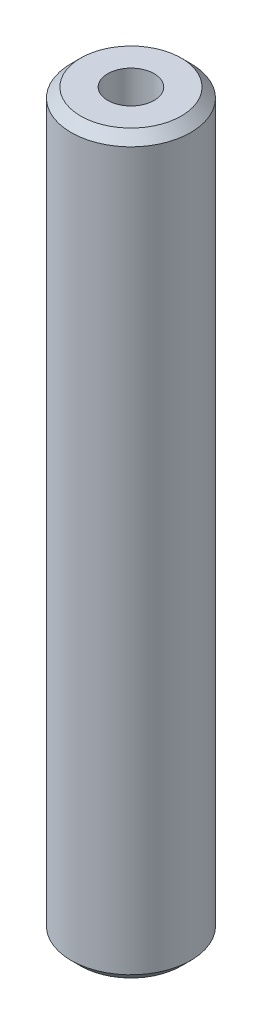
ISO-10303-21;
HEADER;
FILE_DESCRIPTION(('STEP AP214'),'2;1');
FILE_NAME('part.step','',(''),(''),'','','');
FILE_SCHEMA(('AUTOMOTIVE_DESIGN { 1 0 10303 214 1 1 1 1 }'));
ENDSEC;
DATA;
#1=APPLICATION_CONTEXT('core data for automotive mechanical design processes');
#2=APPLICATION_PROTOCOL_DEFINITION('international standard','automotive_design',2000,#1);
#3=PRODUCT_CONTEXT('',#1,'mechanical');
#4=PRODUCT('Part','Part','',(#3));
#5=PRODUCT_RELATED_PRODUCT_CATEGORY('part','',(#4));
#6=PRODUCT_DEFINITION_FORMATION('','',#4);
#7=PRODUCT_DEFINITION_CONTEXT('part definition',#1,'design');
#8=PRODUCT_DEFINITION('design','',#6,#7);
#9=PRODUCT_DEFINITION_SHAPE('','',#8);
#10=(LENGTH_UNIT() NAMED_UNIT(*) SI_UNIT(.MILLI.,.METRE.));
#11=(NAMED_UNIT(*) PLANE_ANGLE_UNIT() SI_UNIT($,.RADIAN.));
#12=(NAMED_UNIT(*) SI_UNIT($,.STERADIAN.) SOLID_ANGLE_UNIT());
#13=UNCERTAINTY_MEASURE_WITH_UNIT(LENGTH_MEASURE(1.E-05),#10,'distance_accuracy_value','');
#14=(GEOMETRIC_REPRESENTATION_CONTEXT(3) GLOBAL_UNCERTAINTY_ASSIGNED_CONTEXT((#13)) GLOBAL_UNIT_ASSIGNED_CONTEXT((#10,
#11,#12)) REPRESENTATION_CONTEXT('',''));
#15=CARTESIAN_POINT('',(0.,0.,0.));
#16=DIRECTION('',(0.,0.,1.));
#17=DIRECTION('',(1.,0.,0.));
#18=AXIS2_PLACEMENT_3D('',#15,#16,#17);
#19=CARTESIAN_POINT('',(0.,153.861780059659,0.));
#20=DIRECTION('',(0.,-1.,0.));
#21=DIRECTION('',(0.,0.,-1.));
#22=AXIS2_PLACEMENT_3D('',#19,#20,#21);
#23=CYLINDRICAL_SURFACE('',#22,12.5);
#24=CARTESIAN_POINT('',(0.,151.870339190849,0.));
#25=DIRECTION('',(0.,1.,0.));
#26=DIRECTION('',(0.,0.,1.));
#27=AXIS2_PLACEMENT_3D('',#24,#25,#26);
#28=CIRCLE('',#27,12.5);
#29=CARTESIAN_POINT('',(0.,151.870339190849,12.5));
#30=VERTEX_POINT('',#29);
#31=EDGE_CURVE('E50',#30,#30,#28,.F.);
#32=ORIENTED_EDGE('',*,*,#31,.T.);
#33=EDGE_LOOP('',(#32));
#34=FACE_BOUND('',#33,.T.);
#35=CARTESIAN_POINT('',(0.,1.99144086881009,0.));
#36=DIRECTION('',(0.,1.,0.));
#37=DIRECTION('',(0.,0.,1.));
#38=AXIS2_PLACEMENT_3D('',#35,#36,#37);
#39=CIRCLE('',#38,12.5);
#40=CARTESIAN_POINT('',(0.,1.99144086881009,12.5));
#41=VERTEX_POINT('',#40);
#42=EDGE_CURVE('E51',#41,#41,#39,.T.);
#43=ORIENTED_EDGE('',*,*,#42,.T.);
#44=EDGE_LOOP('',(#43));
#45=FACE_BOUND('',#44,.T.);
#46=ADVANCED_FACE('F39',(#34,#45),#23,.T.);
#47=CARTESIAN_POINT('',(0.,153.861780059659,0.));
#48=DIRECTION('',(0.,1.,0.));
#49=DIRECTION('',(0.,0.,1.));
#50=AXIS2_PLACEMENT_3D('',#47,#48,#49);
#51=PLANE('',#50);
#52=CARTESIAN_POINT('',(0.,153.861780059659,0.));
#53=DIRECTION('',(0.,1.,0.));
#54=DIRECTION('',(0.,0.,1.));
#55=AXIS2_PLACEMENT_3D('',#52,#53,#54);
#56=CIRCLE('',#55,10.5085591311899);
#57=CARTESIAN_POINT('',(0.,153.861780059659,10.5085591311899));
#58=VERTEX_POINT('',#57);
#59=EDGE_CURVE('E54',#58,#58,#56,.T.);
#60=ORIENTED_EDGE('',*,*,#59,.T.);
#61=EDGE_LOOP('',(#60));
#62=FACE_BOUND('',#61,.T.);
#63=CARTESIAN_POINT('',(0.,153.861780059659,0.));
#64=DIRECTION('',(0.,1.,0.));
#65=DIRECTION('',(0.,0.,1.));
#66=AXIS2_PLACEMENT_3D('',#63,#64,#65);
#67=CIRCLE('',#66,4.85060590893358);
#68=CARTESIAN_POINT('',(0.,153.861780059659,4.85060590893358));
#69=VERTEX_POINT('',#68);
#70=EDGE_CURVE('E58',#69,#69,#67,.T.);
#71=ORIENTED_EDGE('',*,*,#70,.F.);
#72=EDGE_LOOP('',(#71));
#73=FACE_BOUND('',#72,.T.);
#74=ADVANCED_FACE('F69',(#62,#73),#51,.T.);
#75=CARTESIAN_POINT('',(0.,0.,0.));
#76=DIRECTION('',(0.,1.,0.));
#77=DIRECTION('',(0.,0.,1.));
#78=AXIS2_PLACEMENT_3D('',#75,#76,#77);
#79=PLANE('',#78);
#80=CARTESIAN_POINT('',(0.,0.,0.));
#81=DIRECTION('',(0.,1.,0.));
#82=DIRECTION('',(0.,0.,1.));
#83=AXIS2_PLACEMENT_3D('',#80,#81,#82);
#84=CIRCLE('',#83,10.5085591311899);
#85=CARTESIAN_POINT('',(0.,0.,10.5085591311899));
#86=VERTEX_POINT('',#85);
#87=EDGE_CURVE('E10',#86,#86,#84,.F.);
#88=ORIENTED_EDGE('',*,*,#87,.T.);
#89=EDGE_LOOP('',(#88));
#90=FACE_BOUND('',#89,.T.);
#91=CARTESIAN_POINT('',(0.,0.,0.));
#92=DIRECTION('',(0.,1.,0.));
#93=DIRECTION('',(0.,0.,1.));
#94=AXIS2_PLACEMENT_3D('',#91,#92,#93);
#95=CIRCLE('',#94,4.85060590893358);
#96=CARTESIAN_POINT('',(0.,0.,4.85060590893358));
#97=VERTEX_POINT('',#96);
#98=EDGE_CURVE('E63',#97,#97,#95,.T.);
#99=ORIENTED_EDGE('',*,*,#98,.T.);
#100=EDGE_LOOP('',(#99));
#101=FACE_BOUND('',#100,.T.);
#102=ADVANCED_FACE('F75',(#90,#101),#79,.F.);
#103=CARTESIAN_POINT('',(0.,153.861780059659,0.));
#104=DIRECTION('',(0.,-1.,0.));
#105=DIRECTION('',(0.,0.,-1.));
#106=AXIS2_PLACEMENT_3D('',#103,#104,#105);
#107=CYLINDRICAL_SURFACE('',#106,4.85060590893358);
#108=ORIENTED_EDGE('',*,*,#70,.T.);
#109=EDGE_LOOP('',(#108));
#110=FACE_BOUND('',#109,.T.);
#111=ORIENTED_EDGE('',*,*,#98,.F.);
#112=EDGE_LOOP('',(#111));
#113=FACE_BOUND('',#112,.T.);
#114=ADVANCED_FACE('F70',(#110,#113),#107,.F.);
#115=CARTESIAN_POINT('',(0.,153.861780059659,0.));
#116=DIRECTION('',(0.,-1.,0.));
#117=DIRECTION('',(0.,0.,-1.));
#118=AXIS2_PLACEMENT_3D('',#115,#116,#117);
#119=CONICAL_SURFACE('',#118,10.5085591311899,0.785398163397446);
#120=ORIENTED_EDGE('',*,*,#31,.F.);
#121=EDGE_LOOP('',(#120));
#122=FACE_BOUND('',#121,.T.);
#123=ORIENTED_EDGE('',*,*,#59,.F.);
#124=EDGE_LOOP('',(#123));
#125=FACE_BOUND('',#124,.T.);
#126=ADVANCED_FACE('F81',(#122,#125),#119,.T.);
#127=CARTESIAN_POINT('',(0.,1.99144086881009,0.));
#128=DIRECTION('',(0.,1.,0.));
#129=DIRECTION('',(0.,0.,1.));
#130=AXIS2_PLACEMENT_3D('',#127,#128,#129);
#131=CONICAL_SURFACE('',#130,12.5,0.785398163397456);
#132=ORIENTED_EDGE('',*,*,#87,.F.);
#133=EDGE_LOOP('',(#132));
#134=FACE_BOUND('',#133,.T.);
#135=ORIENTED_EDGE('',*,*,#42,.F.);
#136=EDGE_LOOP('',(#135));
#137=FACE_BOUND('',#136,.T.);
#138=ADVANCED_FACE('F45',(#134,#137),#131,.T.);
#139=CLOSED_SHELL('',(#46,#74,#102,#114,#126,#138));
#140=MANIFOLD_SOLID_BREP('B2',#139);
#141=ADVANCED_BREP_SHAPE_REPRESENTATION('',(#18,#140),#14);
#142=SHAPE_DEFINITION_REPRESENTATION(#9,#141);
ENDSEC;
END-ISO-10303-21;
